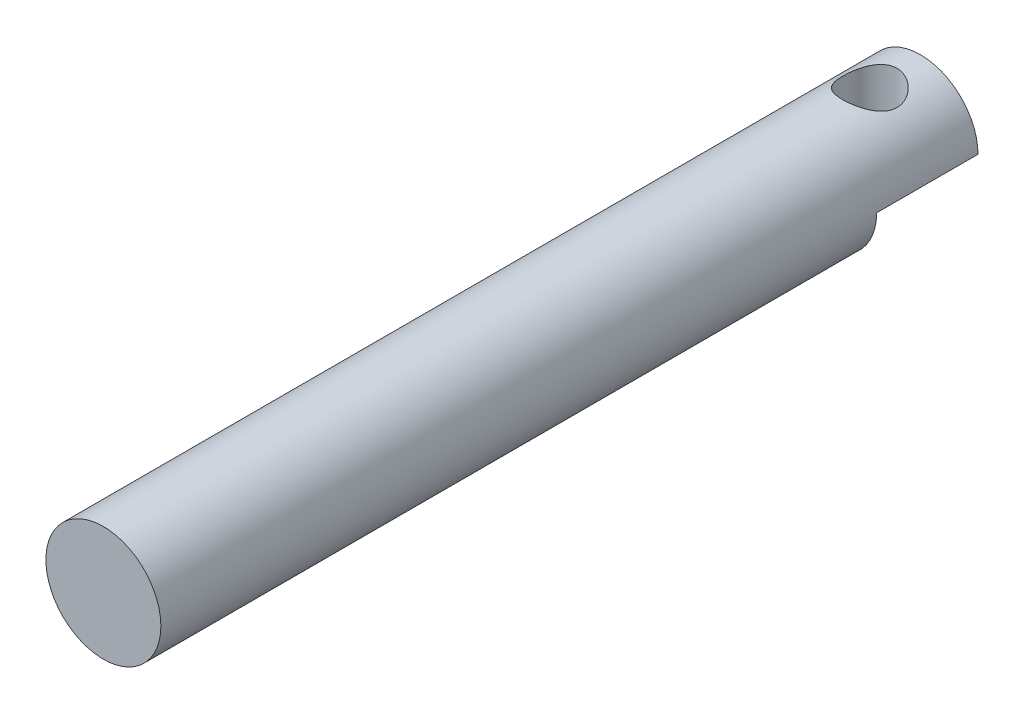
ISO-10303-21;
HEADER;
FILE_DESCRIPTION(('STEP AP214'),'2;1');
FILE_NAME('part.step','',(''),(''),'','','');
FILE_SCHEMA(('AUTOMOTIVE_DESIGN { 1 0 10303 214 1 1 1 1 }'));
ENDSEC;
DATA;
#1=APPLICATION_CONTEXT('core data for automotive mechanical design processes');
#2=APPLICATION_PROTOCOL_DEFINITION('international standard','automotive_design',2000,#1);
#3=PRODUCT_CONTEXT('',#1,'mechanical');
#4=PRODUCT('Part','Part','',(#3));
#5=PRODUCT_RELATED_PRODUCT_CATEGORY('part','',(#4));
#6=PRODUCT_DEFINITION_FORMATION('','',#4);
#7=PRODUCT_DEFINITION_CONTEXT('part definition',#1,'design');
#8=PRODUCT_DEFINITION('design','',#6,#7);
#9=PRODUCT_DEFINITION_SHAPE('','',#8);
#10=(LENGTH_UNIT() NAMED_UNIT(*) SI_UNIT(.MILLI.,.METRE.));
#11=(NAMED_UNIT(*) PLANE_ANGLE_UNIT() SI_UNIT($,.RADIAN.));
#12=(NAMED_UNIT(*) SI_UNIT($,.STERADIAN.) SOLID_ANGLE_UNIT());
#13=UNCERTAINTY_MEASURE_WITH_UNIT(LENGTH_MEASURE(1.E-05),#10,'distance_accuracy_value','');
#14=(GEOMETRIC_REPRESENTATION_CONTEXT(3) GLOBAL_UNCERTAINTY_ASSIGNED_CONTEXT((#13)) GLOBAL_UNIT_ASSIGNED_CONTEXT((#10,
#11,#12)) REPRESENTATION_CONTEXT('',''));
#15=CARTESIAN_POINT('',(0.,0.,0.));
#16=DIRECTION('',(0.,0.,1.));
#17=DIRECTION('',(1.,0.,0.));
#18=AXIS2_PLACEMENT_3D('',#15,#16,#17);
#19=CARTESIAN_POINT('',(0.,0.,45.12));
#20=DIRECTION('',(0.,0.,-1.));
#21=DIRECTION('',(-1.,0.,0.));
#22=AXIS2_PLACEMENT_3D('',#19,#20,#21);
#23=CYLINDRICAL_SURFACE('',#22,3.175);
#24=CARTESIAN_POINT('',(0.,3.175,1.298639110121));
#25=CARTESIAN_POINT('',(0.0793696056331878,3.17499621985294,1.29864358401749));
#26=CARTESIAN_POINT('',(0.158848966213319,3.17199120370814,1.30497575663682));
#27=CARTESIAN_POINT('',(0.3154907966577,3.16026762742416,1.3300394972635));
#28=CARTESIAN_POINT('',(0.392647876041672,3.15153670753249,1.34879788899524));
#29=CARTESIAN_POINT('',(0.542134614016449,3.1292818514019,1.39783447626072));
#30=CARTESIAN_POINT('',(0.614481134826973,3.11577583396693,1.42806963543296));
#31=CARTESIAN_POINT('',(0.75298275747988,3.08523557557938,1.49899464180355));
#32=CARTESIAN_POINT('',(0.819138798737004,3.06820187122341,1.53968289920678));
#33=CARTESIAN_POINT('',(0.947531977551392,3.03109215002452,1.63295248257413));
#34=CARTESIAN_POINT('',(1.00934531536298,3.01089949607389,1.68607019246839));
#35=CARTESIAN_POINT('',(1.12356872804671,2.97016877751052,1.80154509470294));
#36=CARTESIAN_POINT('',(1.17597245123061,2.94963048974006,1.86390847660953));
#37=CARTESIAN_POINT('',(1.27340721108708,2.90895734211161,2.00115474557129));
#38=CARTESIAN_POINT('',(1.31770529611402,2.88894252906622,2.07659756697617));
#39=CARTESIAN_POINT('',(1.39279860497067,2.85350194913633,2.23492460407023));
#40=CARTESIAN_POINT('',(1.4236026358555,2.83807319122874,2.31780392355008));
#41=CARTESIAN_POINT('',(1.46896762087975,2.81484981523147,2.48382178014453));
#42=CARTESIAN_POINT('',(1.48434942407678,2.80667245171199,2.56668000553453));
#43=CARTESIAN_POINT('',(1.50096994970779,2.79782290647243,2.73417241045147));
#44=CARTESIAN_POINT('',(1.5022201551264,2.79714463118969,2.81880509206106));
#45=CARTESIAN_POINT('',(1.49114871052963,2.80305593263808,2.97801441871873));
#46=CARTESIAN_POINT('',(1.48022366031689,2.80889771224103,3.05272226956534));
#47=CARTESIAN_POINT('',(1.44750469243097,2.82589657910714,3.19908379098575));
#48=CARTESIAN_POINT('',(1.42570787921159,2.83705508237193,3.27073664238039));
#49=CARTESIAN_POINT('',(1.37144042107045,2.86368711079333,3.41096056737315));
#50=CARTESIAN_POINT('',(1.33873421633754,2.87925460442575,3.4794218033916));
#51=CARTESIAN_POINT('',(1.26375034917989,2.91294481240157,3.61019488081281));
#52=CARTESIAN_POINT('',(1.22146847336964,2.93106865023239,3.67250399784236));
#53=CARTESIAN_POINT('',(1.12301829304094,2.97027967308475,3.79652512801958));
#54=CARTESIAN_POINT('',(1.06582685913966,2.99147184174414,3.85739445185649));
#55=CARTESIAN_POINT('',(0.941911654521739,3.03276969244737,3.96900603113314));
#56=CARTESIAN_POINT('',(0.875184240523148,3.05287495516681,4.01974439813375));
#57=CARTESIAN_POINT('',(0.730900451942526,3.09065813188422,4.11140464061559));
#58=CARTESIAN_POINT('',(0.653032764749391,3.10821737934191,4.1518892352116));
#59=CARTESIAN_POINT('',(0.490549806409965,3.13795896561378,4.21887396286228));
#60=CARTESIAN_POINT('',(0.405939389394617,3.15014513198241,4.24538405340045));
#61=CARTESIAN_POINT('',(0.239325331183663,3.16698849385516,4.28168583182046));
#62=CARTESIAN_POINT('',(0.15761808537237,3.17215069636453,4.29260213237233));
#63=CARTESIAN_POINT('',(-0.00662006237334085,3.17605374308904,4.30087361184628));
#64=CARTESIAN_POINT('',(-0.0891506200914322,3.17479716715133,4.29823423908701));
#65=CARTESIAN_POINT('',(-0.246790904756254,3.16631250425399,4.28018015989507));
#66=CARTESIAN_POINT('',(-0.322025617263288,3.15949303898597,4.26563942799986));
#67=CARTESIAN_POINT('',(-0.468859911387632,3.14106249856194,4.22551164382716));
#68=CARTESIAN_POINT('',(-0.540459070755478,3.12945086824544,4.19992331169662));
#69=CARTESIAN_POINT('',(-0.680482664613305,3.10206629000487,4.13766633414046));
#70=CARTESIAN_POINT('',(-0.748744433690325,3.0861775760538,4.10068451426519));
#71=CARTESIAN_POINT('',(-0.878333413113474,3.05182842645659,4.01703368457217));
#72=CARTESIAN_POINT('',(-0.939657562453442,3.0333668635778,3.97036042426448));
#73=CARTESIAN_POINT('',(-1.05944471500475,2.99374847615918,3.86379894581481));
#74=CARTESIAN_POINT('',(-1.11715821701519,2.97249840501299,3.80310108003845));
#75=CARTESIAN_POINT('',(-1.22187582163969,2.9310107026401,3.67271906674771));
#76=CARTESIAN_POINT('',(-1.26887443843489,2.91077359415055,3.60303034454683));
#77=CARTESIAN_POINT('',(-1.3523177360002,2.8729842223829,3.45348050442125));
#78=CARTESIAN_POINT('',(-1.3883357483136,2.85555063245793,3.37334883327041));
#79=CARTESIAN_POINT('',(-1.44599796651068,2.82679504093384,3.20706337404008));
#80=CARTESIAN_POINT('',(-1.46765854978947,2.81546607860886,3.12091657183973));
#81=CARTESIAN_POINT('',(-1.49416555358527,2.80148148307169,2.95350251302799));
#82=CARTESIAN_POINT('',(-1.50036748851185,2.79812792823293,2.87250863838967));
#83=CARTESIAN_POINT('',(-1.4995991124721,2.79854075870541,2.7106134382931));
#84=CARTESIAN_POINT('',(-1.4926327833113,2.80230499174775,2.62971209225755));
#85=CARTESIAN_POINT('',(-1.46695547456854,2.81582109373829,2.47677725195426));
#86=CARTESIAN_POINT('',(-1.44918362899975,2.82509293077013,2.40453879441201));
#87=CARTESIAN_POINT('',(-1.40347262111118,2.84807658169596,2.26411015601363));
#88=CARTESIAN_POINT('',(-1.37553039996267,2.86178973121637,2.1959212002645));
#89=CARTESIAN_POINT('',(-1.30816165903836,2.89323433363553,2.06052855829181));
#90=CARTESIAN_POINT('',(-1.26809407534009,2.9111726221189,1.9936931405607));
#91=CARTESIAN_POINT('',(-1.17838069734069,2.94862781691945,1.86727831193667));
#92=CARTESIAN_POINT('',(-1.12873032344155,2.96814547541437,1.80770239264137));
#93=CARTESIAN_POINT('',(-1.01518945377103,3.00898948839188,1.6910830316524));
#94=CARTESIAN_POINT('',(-0.950355540908533,3.03029315236505,1.63494529670393));
#95=CARTESIAN_POINT('',(-0.811506446201233,3.07039060771353,1.53419735584606));
#96=CARTESIAN_POINT('',(-0.737486850130157,3.08918318329392,1.48959272422289));
#97=CARTESIAN_POINT('',(-0.582310323359669,3.12214803509559,1.4135927903461));
#98=CARTESIAN_POINT('',(-0.501179295246575,3.13633626105316,1.38215177628181));
#99=CARTESIAN_POINT('',(-0.334041202489532,3.15849550789229,1.33373668609546));
#100=CARTESIAN_POINT('',(-0.2480493570789,3.16648489362115,1.31671986252476));
#101=CARTESIAN_POINT('',(-0.134449327489636,3.17226666174443,1.30443267672258));
#102=CARTESIAN_POINT('',(-0.10761975081623,3.17328951708221,1.30226255812423));
#103=CARTESIAN_POINT('',(-0.0538643319459688,3.17465683516496,1.29936499974011));
#104=CARTESIAN_POINT('',(-0.0269384876468133,3.17500128300303,1.29863759165553));
#105=CARTESIAN_POINT('',(0.,3.175,1.298639110121));
#106=B_SPLINE_CURVE_WITH_KNOTS('',3,(#24,#25,#26,#27,#28,#29,#30,#31,#32,#33,#34,#35,#36,#37,
#38,#39,#40,#41,#42,#43,#44,#45,#46,#47,#48,#49,#50,#51,#52,#53,#54,#55,#56,#57,#58,#59,#60,#61,
#62,#63,#64,#65,#66,#67,#68,#69,#70,#71,#72,#73,#74,#75,#76,#77,#78,#79,#80,#81,#82,#83,#84,#85,
#86,#87,#88,#89,#90,#91,#92,#93,#94,#95,#96,#97,#98,#99,#100,#101,#102,#103,#104,#105),
.UNSPECIFIED.,.T.,.F.,(4,2,2,2,2,2,2,2,2,2,2,2,2,2,2,2,2,2,2,2,2,2,2,2,2,2,2,2,2,2,2,2,2,2,2,2,
2,2,2,2,4),(0.,0.237998863435127,0.476513162034361,0.714141760487185,0.951734239756923,
1.202566267352,1.45356698050229,1.72144991719773,1.98915775546694,2.24170968929962,
2.4940563909499,2.72018464462581,2.94637315667183,3.17780125644152,3.40933138528568,
3.66670059385932,3.92416839616743,4.19124985366182,4.45814074508092,4.70459764976704,
4.9509555058397,5.18069145066332,5.41045401730286,5.6472008989094,5.88405183355053,
6.14213867221335,6.40035735120202,6.66760822573517,6.93455372246492,7.17710763594645,
7.41958821796886,7.64352093670395,7.86752106087491,8.10644389425159,8.34548119240928,
8.60934561245708,8.8733373285024,9.13640455025375,9.39868939422998,9.47946576344205,
9.56024390756227),.UNSPECIFIED.);
#107=CARTESIAN_POINT('',(0.,3.175,1.298639110121));
#108=VERTEX_POINT('',#107);
#109=EDGE_CURVE('E84',#108,#108,#106,.T.);
#110=ORIENTED_EDGE('',*,*,#109,.T.);
#111=EDGE_LOOP('',(#110));
#112=FACE_BOUND('',#111,.T.);
#113=CARTESIAN_POINT('',(0.,0.,45.12));
#114=DIRECTION('',(0.,0.,1.));
#115=DIRECTION('',(1.,0.,0.));
#116=AXIS2_PLACEMENT_3D('',#113,#114,#115);
#117=CIRCLE('',#116,3.175);
#118=CARTESIAN_POINT('',(3.175,0.,45.12));
#119=VERTEX_POINT('',#118);
#120=EDGE_CURVE('E56',#119,#119,#117,.T.);
#121=ORIENTED_EDGE('',*,*,#120,.F.);
#122=EDGE_LOOP('',(#121));
#123=FACE_BOUND('',#122,.T.);
#124=CARTESIAN_POINT('',(0.,0.,5.597278220242));
#125=DIRECTION('',(0.,0.,1.));
#126=DIRECTION('',(1.,0.,0.));
#127=AXIS2_PLACEMENT_3D('',#124,#125,#126);
#128=CIRCLE('',#127,3.175);
#129=CARTESIAN_POINT('',(-3.175,0.,5.597278220242));
#130=VERTEX_POINT('',#129);
#131=CARTESIAN_POINT('',(3.175,0.,5.597278220242));
#132=VERTEX_POINT('',#131);
#133=EDGE_CURVE('E13',#130,#132,#128,.T.);
#134=ORIENTED_EDGE('',*,*,#133,.T.);
#135=DIRECTION('',(0.,0.,-1.));
#136=VECTOR('',#135,1.);
#137=CARTESIAN_POINT('',(3.175,0.,0.));
#138=LINE('',#137,#136);
#139=CARTESIAN_POINT('',(3.175,0.,0.));
#140=VERTEX_POINT('',#139);
#141=EDGE_CURVE('E79',#132,#140,#138,.T.);
#142=ORIENTED_EDGE('',*,*,#141,.T.);
#143=CARTESIAN_POINT('',(0.,0.,0.));
#144=DIRECTION('',(0.,0.,1.));
#145=DIRECTION('',(1.,0.,0.));
#146=AXIS2_PLACEMENT_3D('',#143,#144,#145);
#147=CIRCLE('',#146,3.175);
#148=CARTESIAN_POINT('',(-3.175,0.,0.));
#149=VERTEX_POINT('',#148);
#150=EDGE_CURVE('E83',#140,#149,#147,.T.);
#151=ORIENTED_EDGE('',*,*,#150,.T.);
#152=DIRECTION('',(0.,0.,1.));
#153=VECTOR('',#152,1.);
#154=CARTESIAN_POINT('',(-3.175,0.,0.));
#155=LINE('',#154,#153);
#156=EDGE_CURVE('E63',#149,#130,#155,.T.);
#157=ORIENTED_EDGE('',*,*,#156,.T.);
#158=EDGE_LOOP('',(#134,#142,#151,#157));
#159=FACE_BOUND('',#158,.T.);
#160=ADVANCED_FACE('F48',(#112,#123,#159),#23,.T.);
#161=CARTESIAN_POINT('',(0.,0.,45.12));
#162=DIRECTION('',(0.,0.,1.));
#163=DIRECTION('',(1.,0.,0.));
#164=AXIS2_PLACEMENT_3D('',#161,#162,#163);
#165=PLANE('',#164);
#166=ORIENTED_EDGE('',*,*,#120,.T.);
#167=EDGE_LOOP('',(#166));
#168=FACE_BOUND('',#167,.T.);
#169=ADVANCED_FACE('F100',(#168),#165,.T.);
#170=CARTESIAN_POINT('',(0.,0.,0.));
#171=DIRECTION('',(0.,0.,1.));
#172=DIRECTION('',(1.,0.,0.));
#173=AXIS2_PLACEMENT_3D('',#170,#171,#172);
#174=PLANE('',#173);
#175=ORIENTED_EDGE('',*,*,#150,.F.);
#176=DIRECTION('',(-1.,0.,0.));
#177=VECTOR('',#176,1.);
#178=CARTESIAN_POINT('',(-3.175,0.,0.));
#179=LINE('',#178,#177);
#180=EDGE_CURVE('E67',#140,#149,#179,.T.);
#181=ORIENTED_EDGE('',*,*,#180,.T.);
#182=EDGE_LOOP('',(#175,#181));
#183=FACE_BOUND('',#182,.T.);
#184=ADVANCED_FACE('F107',(#183),#174,.F.);
#185=CARTESIAN_POINT('',(-3.175,-7.,5.597278220242));
#186=DIRECTION('',(0.,0.,1.));
#187=DIRECTION('',(1.,0.,0.));
#188=AXIS2_PLACEMENT_3D('',#185,#186,#187);
#189=PLANE('',#188);
#190=DIRECTION('',(1.,0.,0.));
#191=VECTOR('',#190,1.);
#192=CARTESIAN_POINT('',(-3.175,0.,5.597278220242));
#193=LINE('',#192,#191);
#194=EDGE_CURVE('E76',#130,#132,#193,.T.);
#195=ORIENTED_EDGE('',*,*,#194,.T.);
#196=ORIENTED_EDGE('',*,*,#133,.F.);
#197=EDGE_LOOP('',(#195,#196));
#198=FACE_BOUND('',#197,.T.);
#199=ADVANCED_FACE('F75',(#198),#189,.F.);
#200=CARTESIAN_POINT('',(0.,0.,0.));
#201=DIRECTION('',(0.,1.,0.));
#202=DIRECTION('',(0.,0.,1.));
#203=AXIS2_PLACEMENT_3D('',#200,#201,#202);
#204=PLANE('',#203);
#205=CARTESIAN_POINT('',(0.,0.,2.798639110121));
#206=DIRECTION('',(0.,-1.,0.));
#207=DIRECTION('',(0.,0.,-1.));
#208=AXIS2_PLACEMENT_3D('',#205,#206,#207);
#209=CIRCLE('',#208,1.5);
#210=CARTESIAN_POINT('',(0.,0.,1.298639110121));
#211=VERTEX_POINT('',#210);
#212=EDGE_CURVE('E87',#211,#211,#209,.T.);
#213=ORIENTED_EDGE('',*,*,#212,.F.);
#214=EDGE_LOOP('',(#213));
#215=FACE_BOUND('',#214,.T.);
#216=ORIENTED_EDGE('',*,*,#156,.F.);
#217=ORIENTED_EDGE('',*,*,#180,.F.);
#218=ORIENTED_EDGE('',*,*,#141,.F.);
#219=ORIENTED_EDGE('',*,*,#194,.F.);
#220=EDGE_LOOP('',(#216,#217,#218,#219));
#221=FACE_BOUND('',#220,.T.);
#222=ADVANCED_FACE('F78',(#215,#221),#204,.F.);
#223=CARTESIAN_POINT('',(0.,7.,2.798639110121));
#224=DIRECTION('',(0.,-1.,0.));
#225=DIRECTION('',(0.,0.,-1.));
#226=AXIS2_PLACEMENT_3D('',#223,#224,#225);
#227=CYLINDRICAL_SURFACE('',#226,1.5);
#228=ORIENTED_EDGE('',*,*,#212,.T.);
#229=EDGE_LOOP('',(#228));
#230=FACE_BOUND('',#229,.T.);
#231=ORIENTED_EDGE('',*,*,#109,.F.);
#232=EDGE_LOOP('',(#231));
#233=FACE_BOUND('',#232,.T.);
#234=ADVANCED_FACE('F111',(#230,#233),#227,.F.);
#235=CLOSED_SHELL('',(#160,#169,#184,#199,#222,#234));
#236=MANIFOLD_SOLID_BREP('B2',#235);
#237=ADVANCED_BREP_SHAPE_REPRESENTATION('',(#18,#236),#14);
#238=SHAPE_DEFINITION_REPRESENTATION(#9,#237);
ENDSEC;
END-ISO-10303-21;
